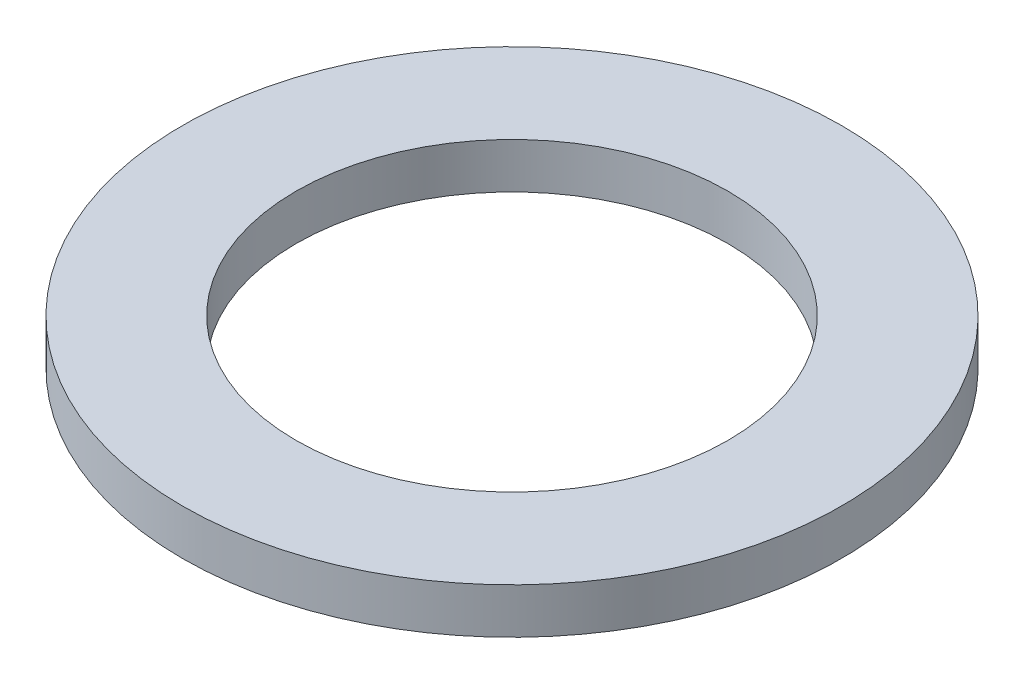
ISO-10303-21;
HEADER;
FILE_DESCRIPTION(('STEP AP214'),'2;1');
FILE_NAME('part.step','',(''),(''),'','','');
FILE_SCHEMA(('AUTOMOTIVE_DESIGN { 1 0 10303 214 1 1 1 1 }'));
ENDSEC;
DATA;
#1=APPLICATION_CONTEXT('core data for automotive mechanical design processes');
#2=APPLICATION_PROTOCOL_DEFINITION('international standard','automotive_design',2000,#1);
#3=PRODUCT_CONTEXT('',#1,'mechanical');
#4=PRODUCT('Part','Part','',(#3));
#5=PRODUCT_RELATED_PRODUCT_CATEGORY('part','',(#4));
#6=PRODUCT_DEFINITION_FORMATION('','',#4);
#7=PRODUCT_DEFINITION_CONTEXT('part definition',#1,'design');
#8=PRODUCT_DEFINITION('design','',#6,#7);
#9=PRODUCT_DEFINITION_SHAPE('','',#8);
#10=(LENGTH_UNIT() NAMED_UNIT(*) SI_UNIT(.MILLI.,.METRE.));
#11=(NAMED_UNIT(*) PLANE_ANGLE_UNIT() SI_UNIT($,.RADIAN.));
#12=(NAMED_UNIT(*) SI_UNIT($,.STERADIAN.) SOLID_ANGLE_UNIT());
#13=UNCERTAINTY_MEASURE_WITH_UNIT(LENGTH_MEASURE(1.E-05),#10,'distance_accuracy_value','');
#14=(GEOMETRIC_REPRESENTATION_CONTEXT(3) GLOBAL_UNCERTAINTY_ASSIGNED_CONTEXT((#13)) GLOBAL_UNIT_ASSIGNED_CONTEXT((#10,
#11,#12)) REPRESENTATION_CONTEXT('',''));
#15=CARTESIAN_POINT('',(0.,0.,0.));
#16=DIRECTION('',(0.,0.,1.));
#17=DIRECTION('',(1.,0.,0.));
#18=AXIS2_PLACEMENT_3D('',#15,#16,#17);
#19=CARTESIAN_POINT('',(0.,10.,0.));
#20=DIRECTION('',(0.,-1.,0.));
#21=DIRECTION('',(0.,0.,-1.));
#22=AXIS2_PLACEMENT_3D('',#19,#20,#21);
#23=CYLINDRICAL_SURFACE('',#22,72.5);
#24=CARTESIAN_POINT('',(0.,10.,0.));
#25=DIRECTION('',(0.,1.,0.));
#26=DIRECTION('',(0.,0.,1.));
#27=AXIS2_PLACEMENT_3D('',#24,#25,#26);
#28=CIRCLE('',#27,72.5);
#29=CARTESIAN_POINT('',(0.,10.,72.5));
#30=VERTEX_POINT('',#29);
#31=EDGE_CURVE('E10',#30,#30,#28,.T.);
#32=ORIENTED_EDGE('',*,*,#31,.F.);
#33=EDGE_LOOP('',(#32));
#34=FACE_BOUND('',#33,.T.);
#35=CARTESIAN_POINT('',(0.,0.,0.));
#36=DIRECTION('',(0.,1.,0.));
#37=DIRECTION('',(0.,0.,1.));
#38=AXIS2_PLACEMENT_3D('',#35,#36,#37);
#39=CIRCLE('',#38,72.5);
#40=CARTESIAN_POINT('',(0.,0.,72.5));
#41=VERTEX_POINT('',#40);
#42=EDGE_CURVE('E37',#41,#41,#39,.T.);
#43=ORIENTED_EDGE('',*,*,#42,.T.);
#44=EDGE_LOOP('',(#43));
#45=FACE_BOUND('',#44,.T.);
#46=ADVANCED_FACE('F40',(#34,#45),#23,.T.);
#47=CARTESIAN_POINT('',(0.,10.,0.));
#48=DIRECTION('',(0.,1.,0.));
#49=DIRECTION('',(0.,0.,1.));
#50=AXIS2_PLACEMENT_3D('',#47,#48,#49);
#51=PLANE('',#50);
#52=CARTESIAN_POINT('',(0.,10.,0.));
#53=DIRECTION('',(0.,1.,0.));
#54=DIRECTION('',(0.,0.,1.));
#55=AXIS2_PLACEMENT_3D('',#52,#53,#54);
#56=CIRCLE('',#55,47.5);
#57=CARTESIAN_POINT('',(0.,10.,47.5));
#58=VERTEX_POINT('',#57);
#59=EDGE_CURVE('E50',#58,#58,#56,.T.);
#60=ORIENTED_EDGE('',*,*,#59,.F.);
#61=EDGE_LOOP('',(#60));
#62=FACE_BOUND('',#61,.T.);
#63=ORIENTED_EDGE('',*,*,#31,.T.);
#64=EDGE_LOOP('',(#63));
#65=FACE_BOUND('',#64,.T.);
#66=ADVANCED_FACE('F59',(#62,#65),#51,.T.);
#67=CARTESIAN_POINT('',(0.,0.,0.));
#68=DIRECTION('',(0.,1.,0.));
#69=DIRECTION('',(0.,0.,1.));
#70=AXIS2_PLACEMENT_3D('',#67,#68,#69);
#71=PLANE('',#70);
#72=CARTESIAN_POINT('',(0.,0.,0.));
#73=DIRECTION('',(0.,1.,0.));
#74=DIRECTION('',(0.,0.,1.));
#75=AXIS2_PLACEMENT_3D('',#72,#73,#74);
#76=CIRCLE('',#75,47.5);
#77=CARTESIAN_POINT('',(0.,0.,47.5));
#78=VERTEX_POINT('',#77);
#79=EDGE_CURVE('E47',#78,#78,#76,.T.);
#80=ORIENTED_EDGE('',*,*,#79,.T.);
#81=EDGE_LOOP('',(#80));
#82=FACE_BOUND('',#81,.T.);
#83=ORIENTED_EDGE('',*,*,#42,.F.);
#84=EDGE_LOOP('',(#83));
#85=FACE_BOUND('',#84,.T.);
#86=ADVANCED_FACE('F58',(#82,#85),#71,.F.);
#87=CARTESIAN_POINT('',(0.,10.,0.));
#88=DIRECTION('',(0.,-1.,0.));
#89=DIRECTION('',(0.,0.,-1.));
#90=AXIS2_PLACEMENT_3D('',#87,#88,#89);
#91=CYLINDRICAL_SURFACE('',#90,47.5);
#92=ORIENTED_EDGE('',*,*,#59,.T.);
#93=EDGE_LOOP('',(#92));
#94=FACE_BOUND('',#93,.T.);
#95=ORIENTED_EDGE('',*,*,#79,.F.);
#96=EDGE_LOOP('',(#95));
#97=FACE_BOUND('',#96,.T.);
#98=ADVANCED_FACE('F54',(#94,#97),#91,.F.);
#99=CLOSED_SHELL('',(#46,#66,#86,#98));
#100=MANIFOLD_SOLID_BREP('B2',#99);
#101=ADVANCED_BREP_SHAPE_REPRESENTATION('',(#18,#100),#14);
#102=SHAPE_DEFINITION_REPRESENTATION(#9,#101);
ENDSEC;
END-ISO-10303-21;
